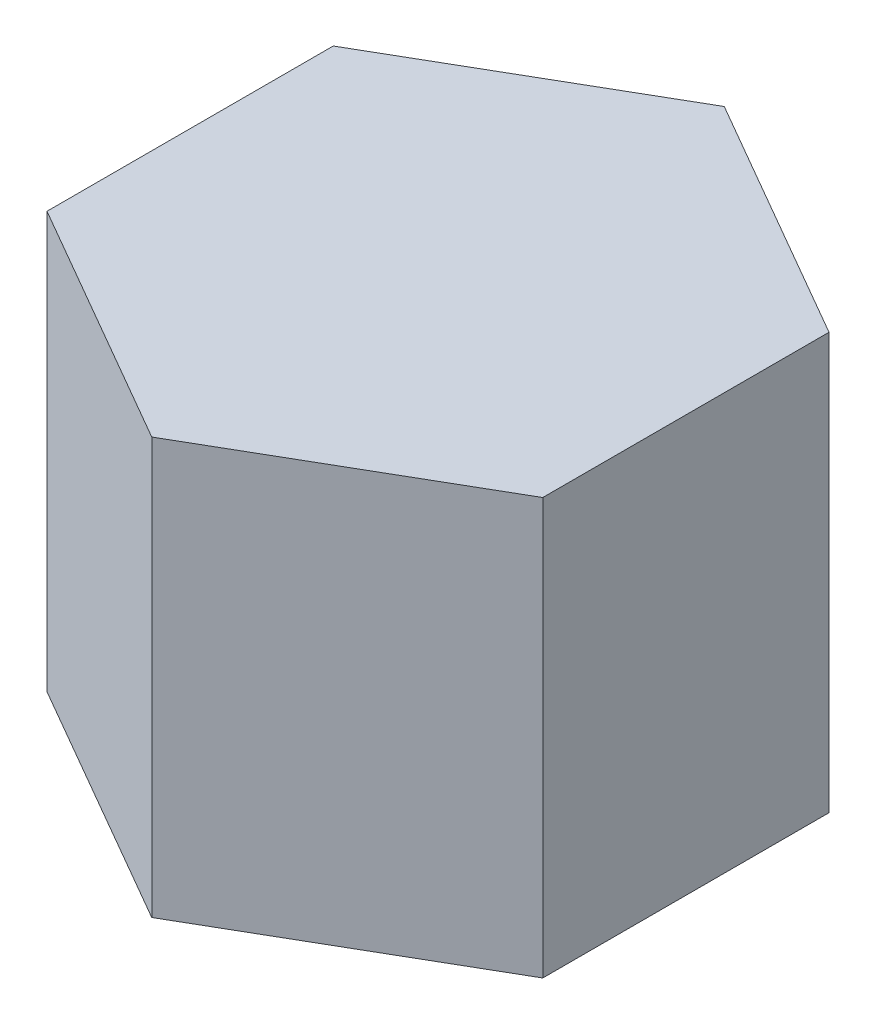
ISO-10303-21;
HEADER;
FILE_DESCRIPTION(('STEP AP214'),'2;1');
FILE_NAME('part.step','',(''),(''),'','','');
FILE_SCHEMA(('AUTOMOTIVE_DESIGN { 1 0 10303 214 1 1 1 1 }'));
ENDSEC;
DATA;
#1=APPLICATION_CONTEXT('core data for automotive mechanical design processes');
#2=APPLICATION_PROTOCOL_DEFINITION('international standard','automotive_design',2000,#1);
#3=PRODUCT_CONTEXT('',#1,'mechanical');
#4=PRODUCT('Part','Part','',(#3));
#5=PRODUCT_RELATED_PRODUCT_CATEGORY('part','',(#4));
#6=PRODUCT_DEFINITION_FORMATION('','',#4);
#7=PRODUCT_DEFINITION_CONTEXT('part definition',#1,'design');
#8=PRODUCT_DEFINITION('design','',#6,#7);
#9=PRODUCT_DEFINITION_SHAPE('','',#8);
#10=(LENGTH_UNIT() NAMED_UNIT(*) SI_UNIT(.MILLI.,.METRE.));
#11=(NAMED_UNIT(*) PLANE_ANGLE_UNIT() SI_UNIT($,.RADIAN.));
#12=(NAMED_UNIT(*) SI_UNIT($,.STERADIAN.) SOLID_ANGLE_UNIT());
#13=UNCERTAINTY_MEASURE_WITH_UNIT(LENGTH_MEASURE(1.E-05),#10,'distance_accuracy_value','');
#14=(GEOMETRIC_REPRESENTATION_CONTEXT(3) GLOBAL_UNCERTAINTY_ASSIGNED_CONTEXT((#13)) GLOBAL_UNIT_ASSIGNED_CONTEXT((#10,
#11,#12)) REPRESENTATION_CONTEXT('',''));
#15=CARTESIAN_POINT('',(0.,0.,0.));
#16=DIRECTION('',(0.,0.,1.));
#17=DIRECTION('',(1.,0.,0.));
#18=AXIS2_PLACEMENT_3D('',#15,#16,#17);
#19=CARTESIAN_POINT('',(202.339551417382,-147.556598747966,295.146072835632));
#20=DIRECTION('',(-0.500000000000096,0.,-0.866025403784383));
#21=DIRECTION('',(-0.866025403784383,0.,0.500000000000096));
#22=AXIS2_PLACEMENT_3D('',#19,#20,#21);
#23=PLANE('',#22);
#24=CARTESIAN_POINT('',(202.642660308706,-147.047793579175,294.971072835632));
#25=DIRECTION('',(-0.866025403784383,0.,0.500000000000096));
#26=VECTOR('',#25,1.);
#27=LINE('',#24,#26);
#28=CARTESIAN_POINT('',(202.642660308706,-147.047793579175,294.971072835632));
#29=VERTEX_POINT('',#28);
#30=CARTESIAN_POINT('',(202.339551417382,-147.047793579175,295.146072835632));
#31=VERTEX_POINT('',#30);
#32=EDGE_CURVE('E170',#29,#31,#27,.T.);
#33=ORIENTED_EDGE('',*,*,#32,.T.);
#34=CARTESIAN_POINT('',(202.339551417382,-147.556598747966,295.146072835632));
#35=DIRECTION('',(0.,1.,0.));
#36=VECTOR('',#35,1.);
#37=LINE('',#34,#36);
#38=CARTESIAN_POINT('',(202.339551417382,-147.556598747966,295.146072835632));
#39=VERTEX_POINT('',#38);
#40=EDGE_CURVE('E35',#39,#31,#37,.T.);
#41=ORIENTED_EDGE('',*,*,#40,.F.);
#42=CARTESIAN_POINT('',(202.642660308706,-147.556598747966,294.971072835632));
#43=DIRECTION('',(-0.866025403784383,0.,0.500000000000096));
#44=VECTOR('',#43,1.);
#45=LINE('',#42,#44);
#46=CARTESIAN_POINT('',(202.642660308706,-147.556598747966,294.971072835632));
#47=VERTEX_POINT('',#46);
#48=EDGE_CURVE('E159',#47,#39,#45,.T.);
#49=ORIENTED_EDGE('',*,*,#48,.F.);
#50=CARTESIAN_POINT('',(202.642660308706,-147.556598747966,294.971072835632));
#51=DIRECTION('',(0.,1.,0.));
#52=VECTOR('',#51,1.);
#53=LINE('',#50,#52);
#54=EDGE_CURVE('E10',#47,#29,#53,.T.);
#55=ORIENTED_EDGE('',*,*,#54,.T.);
#56=EDGE_LOOP('',(#33,#41,#49,#55));
#57=FACE_BOUND('',#56,.T.);
#58=ADVANCED_FACE('F16',(#57),#23,.F.);
#59=CARTESIAN_POINT('',(202.642660308706,-147.556598747966,291.594471220494));
#60=DIRECTION('',(-1.,0.,0.));
#61=DIRECTION('',(0.,-1.,0.));
#62=AXIS2_PLACEMENT_3D('',#59,#60,#61);
#63=PLANE('',#62);
#64=CARTESIAN_POINT('',(202.642660308706,-147.047793579175,294.621072835632));
#65=DIRECTION('',(0.,0.,1.));
#66=VECTOR('',#65,1.);
#67=LINE('',#64,#66);
#68=CARTESIAN_POINT('',(202.642660308706,-147.047793579175,294.621072835632));
#69=VERTEX_POINT('',#68);
#70=EDGE_CURVE('E167',#69,#29,#67,.T.);
#71=ORIENTED_EDGE('',*,*,#70,.T.);
#72=ORIENTED_EDGE('',*,*,#54,.F.);
#73=CARTESIAN_POINT('',(202.642660308706,-147.556598747966,294.621072835632));
#74=DIRECTION('',(0.,0.,1.));
#75=VECTOR('',#74,1.);
#76=LINE('',#73,#75);
#77=CARTESIAN_POINT('',(202.642660308706,-147.556598747966,294.621072835632));
#78=VERTEX_POINT('',#77);
#79=EDGE_CURVE('E156',#78,#47,#76,.T.);
#80=ORIENTED_EDGE('',*,*,#79,.F.);
#81=CARTESIAN_POINT('',(202.642660308706,-147.556598747966,294.621072835632));
#82=DIRECTION('',(0.,1.,0.));
#83=VECTOR('',#82,1.);
#84=LINE('',#81,#83);
#85=EDGE_CURVE('E27',#78,#69,#84,.T.);
#86=ORIENTED_EDGE('',*,*,#85,.T.);
#87=EDGE_LOOP('',(#71,#72,#80,#86));
#88=FACE_BOUND('',#87,.T.);
#89=ADVANCED_FACE('F189',(#88),#63,.F.);
#90=CARTESIAN_POINT('',(202.642660308706,-147.556598747966,294.621072835632));
#91=DIRECTION('',(-0.499999999999943,0.,0.866025403784471));
#92=DIRECTION('',(0.866025403784471,0.,0.499999999999943));
#93=AXIS2_PLACEMENT_3D('',#90,#91,#92);
#94=PLANE('',#93);
#95=CARTESIAN_POINT('',(202.339551417382,-147.047793579175,294.446072835632));
#96=DIRECTION('',(0.866025403784471,0.,0.499999999999943));
#97=VECTOR('',#96,1.);
#98=LINE('',#95,#97);
#99=CARTESIAN_POINT('',(202.339551417382,-147.047793579175,294.446072835632));
#100=VERTEX_POINT('',#99);
#101=EDGE_CURVE('E163',#100,#69,#98,.T.);
#102=ORIENTED_EDGE('',*,*,#101,.T.);
#103=ORIENTED_EDGE('',*,*,#85,.F.);
#104=CARTESIAN_POINT('',(202.339551417382,-147.556598747966,294.446072835632));
#105=DIRECTION('',(0.866025403784471,0.,0.499999999999943));
#106=VECTOR('',#105,1.);
#107=LINE('',#104,#106);
#108=CARTESIAN_POINT('',(202.339551417382,-147.556598747966,294.446072835632));
#109=VERTEX_POINT('',#108);
#110=EDGE_CURVE('E106',#109,#78,#107,.T.);
#111=ORIENTED_EDGE('',*,*,#110,.F.);
#112=CARTESIAN_POINT('',(202.339551417382,-147.556598747966,294.446072835632));
#113=DIRECTION('',(0.,1.,0.));
#114=VECTOR('',#113,1.);
#115=LINE('',#112,#114);
#116=EDGE_CURVE('E94',#109,#100,#115,.T.);
#117=ORIENTED_EDGE('',*,*,#116,.T.);
#118=EDGE_LOOP('',(#102,#103,#111,#117));
#119=FACE_BOUND('',#118,.T.);
#120=ADVANCED_FACE('F198',(#119),#94,.F.);
#121=CARTESIAN_POINT('',(202.339551417382,-147.556598747966,294.446072835632));
#122=DIRECTION('',(0.499999999999978,0.,0.866025403784452));
#123=DIRECTION('',(0.866025403784452,0.,-0.499999999999978));
#124=AXIS2_PLACEMENT_3D('',#121,#122,#123);
#125=PLANE('',#124);
#126=CARTESIAN_POINT('',(202.036442526057,-147.047793579175,294.621072835632));
#127=DIRECTION('',(0.866025403784452,0.,-0.499999999999978));
#128=VECTOR('',#127,1.);
#129=LINE('',#126,#128);
#130=CARTESIAN_POINT('',(202.036442526057,-147.047793579175,294.621072835632));
#131=VERTEX_POINT('',#130);
#132=EDGE_CURVE('E162',#131,#100,#129,.T.);
#133=ORIENTED_EDGE('',*,*,#132,.T.);
#134=ORIENTED_EDGE('',*,*,#116,.F.);
#135=CARTESIAN_POINT('',(202.036442526057,-147.556598747966,294.621072835632));
#136=DIRECTION('',(0.866025403784452,0.,-0.499999999999978));
#137=VECTOR('',#136,1.);
#138=LINE('',#135,#137);
#139=CARTESIAN_POINT('',(202.036442526057,-147.556598747966,294.621072835632));
#140=VERTEX_POINT('',#139);
#141=EDGE_CURVE('E98',#140,#109,#138,.T.);
#142=ORIENTED_EDGE('',*,*,#141,.F.);
#143=CARTESIAN_POINT('',(202.036442526057,-147.556598747966,294.621072835632));
#144=DIRECTION('',(0.,1.,0.));
#145=VECTOR('',#144,1.);
#146=LINE('',#143,#145);
#147=EDGE_CURVE('E79',#140,#131,#146,.T.);
#148=ORIENTED_EDGE('',*,*,#147,.T.);
#149=EDGE_LOOP('',(#133,#134,#142,#148));
#150=FACE_BOUND('',#149,.T.);
#151=ADVANCED_FACE('F100',(#150),#125,.F.);
#152=CARTESIAN_POINT('',(202.036442526057,-147.556598747966,291.594471220494));
#153=DIRECTION('',(1.,0.,0.));
#154=DIRECTION('',(0.,1.,0.));
#155=AXIS2_PLACEMENT_3D('',#152,#153,#154);
#156=PLANE('',#155);
#157=CARTESIAN_POINT('',(202.036442526057,-147.047793579175,294.971072835632));
#158=DIRECTION('',(0.,0.,-1.));
#159=VECTOR('',#158,1.);
#160=LINE('',#157,#159);
#161=CARTESIAN_POINT('',(202.036442526057,-147.047793579175,294.971072835632));
#162=VERTEX_POINT('',#161);
#163=EDGE_CURVE('E88',#162,#131,#160,.T.);
#164=ORIENTED_EDGE('',*,*,#163,.T.);
#165=ORIENTED_EDGE('',*,*,#147,.F.);
#166=CARTESIAN_POINT('',(202.036442526057,-147.556598747966,294.971072835632));
#167=DIRECTION('',(0.,0.,-1.));
#168=VECTOR('',#167,1.);
#169=LINE('',#166,#168);
#170=CARTESIAN_POINT('',(202.036442526057,-147.556598747966,294.971072835632));
#171=VERTEX_POINT('',#170);
#172=EDGE_CURVE('E84',#171,#140,#169,.T.);
#173=ORIENTED_EDGE('',*,*,#172,.F.);
#174=CARTESIAN_POINT('',(202.036442526057,-147.556598747966,294.971072835632));
#175=DIRECTION('',(0.,1.,0.));
#176=VECTOR('',#175,1.);
#177=LINE('',#174,#176);
#178=EDGE_CURVE('E58',#171,#162,#177,.T.);
#179=ORIENTED_EDGE('',*,*,#178,.T.);
#180=EDGE_LOOP('',(#164,#165,#173,#179));
#181=FACE_BOUND('',#180,.T.);
#182=ADVANCED_FACE('F82',(#181),#156,.F.);
#183=CARTESIAN_POINT('',(202.036442526057,-147.556598747966,294.971072835632));
#184=DIRECTION('',(0.499999999999978,0.,-0.866025403784452));
#185=DIRECTION('',(-0.866025403784452,0.,-0.499999999999978));
#186=AXIS2_PLACEMENT_3D('',#183,#184,#185);
#187=PLANE('',#186);
#188=CARTESIAN_POINT('',(202.339551417382,-147.047793579175,295.146072835632));
#189=DIRECTION('',(-0.866025403784452,0.,-0.499999999999978));
#190=VECTOR('',#189,1.);
#191=LINE('',#188,#190);
#192=EDGE_CURVE('E160',#31,#162,#191,.T.);
#193=ORIENTED_EDGE('',*,*,#192,.T.);
#194=ORIENTED_EDGE('',*,*,#178,.F.);
#195=CARTESIAN_POINT('',(202.339551417382,-147.556598747966,295.146072835632));
#196=DIRECTION('',(-0.866025403784452,0.,-0.499999999999978));
#197=VECTOR('',#196,1.);
#198=LINE('',#195,#197);
#199=EDGE_CURVE('E112',#39,#171,#198,.T.);
#200=ORIENTED_EDGE('',*,*,#199,.F.);
#201=ORIENTED_EDGE('',*,*,#40,.T.);
#202=EDGE_LOOP('',(#193,#194,#200,#201));
#203=FACE_BOUND('',#202,.T.);
#204=ADVANCED_FACE('F131',(#203),#187,.F.);
#205=CARTESIAN_POINT('',(206.491105863044,-147.556598747966,291.594471220494));
#206=DIRECTION('',(0.,1.,0.));
#207=DIRECTION('',(-1.,0.,0.));
#208=AXIS2_PLACEMENT_3D('',#205,#206,#207);
#209=PLANE('',#208);
#210=ORIENTED_EDGE('',*,*,#48,.T.);
#211=ORIENTED_EDGE('',*,*,#199,.T.);
#212=ORIENTED_EDGE('',*,*,#172,.T.);
#213=ORIENTED_EDGE('',*,*,#141,.T.);
#214=ORIENTED_EDGE('',*,*,#110,.T.);
#215=ORIENTED_EDGE('',*,*,#79,.T.);
#216=EDGE_LOOP('',(#210,#211,#212,#213,#214,#215));
#217=FACE_BOUND('',#216,.T.);
#218=ADVANCED_FACE('F111',(#217),#209,.F.);
#219=CARTESIAN_POINT('',(206.491105863044,-147.047793579175,291.594471220494));
#220=DIRECTION('',(0.,1.,0.));
#221=DIRECTION('',(-1.,0.,0.));
#222=AXIS2_PLACEMENT_3D('',#219,#220,#221);
#223=PLANE('',#222);
#224=ORIENTED_EDGE('',*,*,#32,.F.);
#225=ORIENTED_EDGE('',*,*,#70,.F.);
#226=ORIENTED_EDGE('',*,*,#101,.F.);
#227=ORIENTED_EDGE('',*,*,#132,.F.);
#228=ORIENTED_EDGE('',*,*,#163,.F.);
#229=ORIENTED_EDGE('',*,*,#192,.F.);
#230=EDGE_LOOP('',(#224,#225,#226,#227,#228,#229));
#231=FACE_BOUND('',#230,.T.);
#232=ADVANCED_FACE('F130',(#231),#223,.T.);
#233=CLOSED_SHELL('',(#58,#89,#120,#151,#182,#204,#218,#232));
#234=MANIFOLD_SOLID_BREP('B1',#233);
#235=ADVANCED_BREP_SHAPE_REPRESENTATION('',(#18,#234),#14);
#236=SHAPE_DEFINITION_REPRESENTATION(#9,#235);
ENDSEC;
END-ISO-10303-21;
